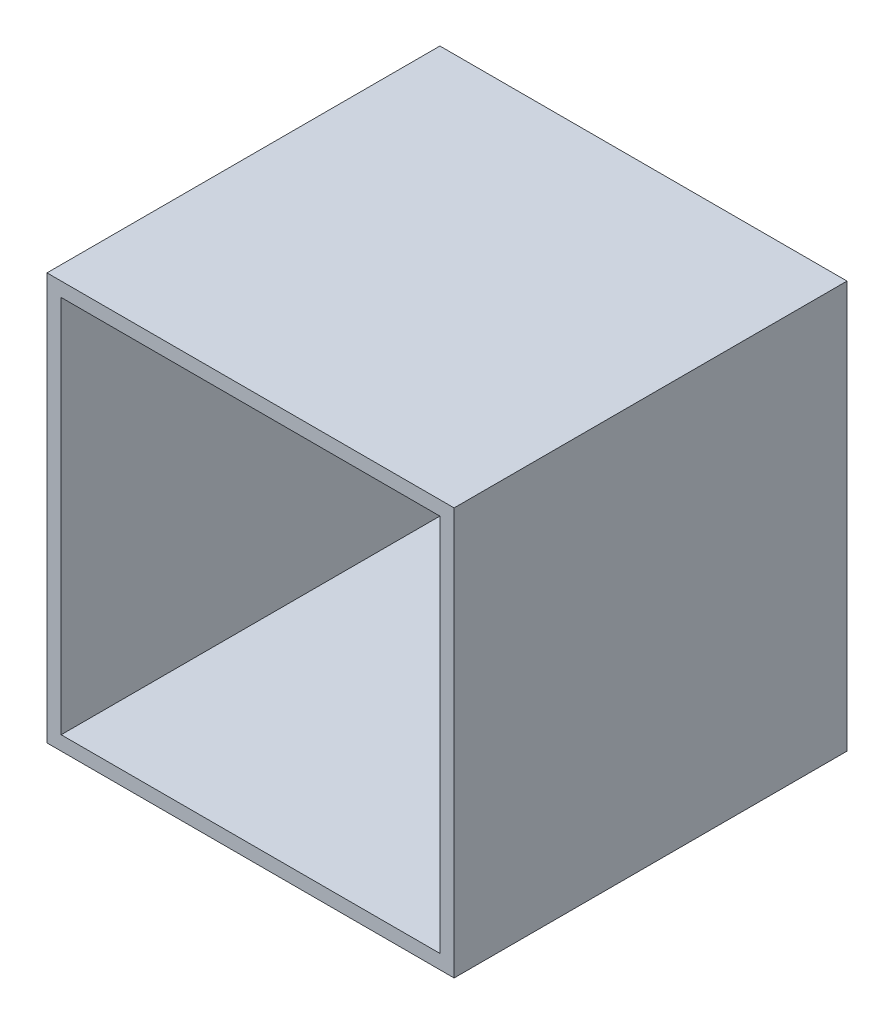
ISO-10303-21;
HEADER;
FILE_DESCRIPTION(('STEP AP214'),'2;1');
FILE_NAME('part.step','',(''),(''),'','','');
FILE_SCHEMA(('AUTOMOTIVE_DESIGN { 1 0 10303 214 1 1 1 1 }'));
ENDSEC;
DATA;
#1=APPLICATION_CONTEXT('core data for automotive mechanical design processes');
#2=APPLICATION_PROTOCOL_DEFINITION('international standard','automotive_design',2000,#1);
#3=PRODUCT_CONTEXT('',#1,'mechanical');
#4=PRODUCT('Part','Part','',(#3));
#5=PRODUCT_RELATED_PRODUCT_CATEGORY('part','',(#4));
#6=PRODUCT_DEFINITION_FORMATION('','',#4);
#7=PRODUCT_DEFINITION_CONTEXT('part definition',#1,'design');
#8=PRODUCT_DEFINITION('design','',#6,#7);
#9=PRODUCT_DEFINITION_SHAPE('','',#8);
#10=(LENGTH_UNIT() NAMED_UNIT(*) SI_UNIT(.MILLI.,.METRE.));
#11=(NAMED_UNIT(*) PLANE_ANGLE_UNIT() SI_UNIT($,.RADIAN.));
#12=(NAMED_UNIT(*) SI_UNIT($,.STERADIAN.) SOLID_ANGLE_UNIT());
#13=UNCERTAINTY_MEASURE_WITH_UNIT(LENGTH_MEASURE(1.E-05),#10,'distance_accuracy_value','');
#14=(GEOMETRIC_REPRESENTATION_CONTEXT(3) GLOBAL_UNCERTAINTY_ASSIGNED_CONTEXT((#13)) GLOBAL_UNIT_ASSIGNED_CONTEXT((#10,
#11,#12)) REPRESENTATION_CONTEXT('',''));
#15=CARTESIAN_POINT('',(0.,0.,0.));
#16=DIRECTION('',(0.,0.,1.));
#17=DIRECTION('',(1.,0.,0.));
#18=AXIS2_PLACEMENT_3D('',#15,#16,#17);
#19=CARTESIAN_POINT('',(0.,0.,80.));
#20=DIRECTION('',(0.,0.,-1.));
#21=DIRECTION('',(-1.,0.,0.));
#22=AXIS2_PLACEMENT_3D('',#19,#20,#21);
#23=PLANE('',#22);
#24=DIRECTION('',(0.,1.,0.));
#25=VECTOR('',#24,1.);
#26=CARTESIAN_POINT('',(43.,43.,80.));
#27=LINE('',#26,#25);
#28=CARTESIAN_POINT('',(43.,-43.,80.));
#29=VERTEX_POINT('',#28);
#30=CARTESIAN_POINT('',(43.,43.,80.));
#31=VERTEX_POINT('',#30);
#32=EDGE_CURVE('E108',#29,#31,#27,.T.);
#33=ORIENTED_EDGE('',*,*,#32,.T.);
#34=DIRECTION('',(-1.,0.,0.));
#35=VECTOR('',#34,1.);
#36=CARTESIAN_POINT('',(43.,43.,80.));
#37=LINE('',#36,#35);
#38=CARTESIAN_POINT('',(-43.,43.,80.));
#39=VERTEX_POINT('',#38);
#40=EDGE_CURVE('E157',#31,#39,#37,.T.);
#41=ORIENTED_EDGE('',*,*,#40,.T.);
#42=DIRECTION('',(0.,-1.,0.));
#43=VECTOR('',#42,1.);
#44=CARTESIAN_POINT('',(-43.,43.,80.));
#45=LINE('',#44,#43);
#46=CARTESIAN_POINT('',(-43.,-43.,80.));
#47=VERTEX_POINT('',#46);
#48=EDGE_CURVE('E159',#39,#47,#45,.T.);
#49=ORIENTED_EDGE('',*,*,#48,.T.);
#50=DIRECTION('',(1.,0.,0.));
#51=VECTOR('',#50,1.);
#52=CARTESIAN_POINT('',(43.,-43.,80.));
#53=LINE('',#52,#51);
#54=EDGE_CURVE('E112',#47,#29,#53,.T.);
#55=ORIENTED_EDGE('',*,*,#54,.T.);
#56=EDGE_LOOP('',(#33,#41,#49,#55));
#57=FACE_BOUND('',#56,.T.);
#58=DIRECTION('',(0.,-1.,0.));
#59=VECTOR('',#58,1.);
#60=CARTESIAN_POINT('',(-40.,40.,80.));
#61=LINE('',#60,#59);
#62=CARTESIAN_POINT('',(-40.,40.,80.));
#63=VERTEX_POINT('',#62);
#64=CARTESIAN_POINT('',(-40.,-40.,80.));
#65=VERTEX_POINT('',#64);
#66=EDGE_CURVE('E131',#63,#65,#61,.T.);
#67=ORIENTED_EDGE('',*,*,#66,.F.);
#68=DIRECTION('',(-1.,0.,0.));
#69=VECTOR('',#68,1.);
#70=CARTESIAN_POINT('',(40.,40.,80.));
#71=LINE('',#70,#69);
#72=CARTESIAN_POINT('',(40.,40.,80.));
#73=VERTEX_POINT('',#72);
#74=EDGE_CURVE('E138',#73,#63,#71,.T.);
#75=ORIENTED_EDGE('',*,*,#74,.F.);
#76=DIRECTION('',(0.,1.,0.));
#77=VECTOR('',#76,1.);
#78=CARTESIAN_POINT('',(40.,40.,80.));
#79=LINE('',#78,#77);
#80=CARTESIAN_POINT('',(40.,-40.,80.));
#81=VERTEX_POINT('',#80);
#82=EDGE_CURVE('E136',#81,#73,#79,.T.);
#83=ORIENTED_EDGE('',*,*,#82,.F.);
#84=DIRECTION('',(1.,0.,0.));
#85=VECTOR('',#84,1.);
#86=CARTESIAN_POINT('',(40.,-40.,80.));
#87=LINE('',#86,#85);
#88=EDGE_CURVE('E133',#65,#81,#87,.T.);
#89=ORIENTED_EDGE('',*,*,#88,.F.);
#90=EDGE_LOOP('',(#67,#75,#83,#89));
#91=FACE_BOUND('',#90,.T.);
#92=ADVANCED_FACE('F35',(#57,#91),#23,.F.);
#93=CARTESIAN_POINT('',(43.,43.,80.));
#94=DIRECTION('',(-1.,0.,0.));
#95=DIRECTION('',(0.,-1.,0.));
#96=AXIS2_PLACEMENT_3D('',#93,#94,#95);
#97=PLANE('',#96);
#98=DIRECTION('',(0.,0.,-1.));
#99=VECTOR('',#98,1.);
#100=CARTESIAN_POINT('',(43.,-43.,80.));
#101=LINE('',#100,#99);
#102=CARTESIAN_POINT('',(43.,-43.,-3.));
#103=VERTEX_POINT('',#102);
#104=EDGE_CURVE('E102',#29,#103,#101,.T.);
#105=ORIENTED_EDGE('',*,*,#104,.T.);
#106=DIRECTION('',(0.,-1.,0.));
#107=VECTOR('',#106,1.);
#108=CARTESIAN_POINT('',(43.,43.,-3.));
#109=LINE('',#108,#107);
#110=CARTESIAN_POINT('',(43.,43.,-3.));
#111=VERTEX_POINT('',#110);
#112=EDGE_CURVE('E106',#111,#103,#109,.T.);
#113=ORIENTED_EDGE('',*,*,#112,.F.);
#114=DIRECTION('',(0.,0.,-1.));
#115=VECTOR('',#114,1.);
#116=CARTESIAN_POINT('',(43.,43.,80.));
#117=LINE('',#116,#115);
#118=EDGE_CURVE('E11',#31,#111,#117,.T.);
#119=ORIENTED_EDGE('',*,*,#118,.F.);
#120=ORIENTED_EDGE('',*,*,#32,.F.);
#121=EDGE_LOOP('',(#105,#113,#119,#120));
#122=FACE_BOUND('',#121,.T.);
#123=ADVANCED_FACE('F37',(#122),#97,.F.);
#124=CARTESIAN_POINT('',(43.,43.,80.));
#125=DIRECTION('',(0.,-1.,0.));
#126=DIRECTION('',(1.,0.,0.));
#127=AXIS2_PLACEMENT_3D('',#124,#125,#126);
#128=PLANE('',#127);
#129=ORIENTED_EDGE('',*,*,#118,.T.);
#130=DIRECTION('',(1.,0.,0.));
#131=VECTOR('',#130,1.);
#132=CARTESIAN_POINT('',(43.,43.,-3.));
#133=LINE('',#132,#131);
#134=CARTESIAN_POINT('',(-43.,43.,-3.));
#135=VERTEX_POINT('',#134);
#136=EDGE_CURVE('E126',#135,#111,#133,.T.);
#137=ORIENTED_EDGE('',*,*,#136,.F.);
#138=DIRECTION('',(0.,0.,-1.));
#139=VECTOR('',#138,1.);
#140=CARTESIAN_POINT('',(-43.,43.,80.));
#141=LINE('',#140,#139);
#142=EDGE_CURVE('E43',#39,#135,#141,.T.);
#143=ORIENTED_EDGE('',*,*,#142,.F.);
#144=ORIENTED_EDGE('',*,*,#40,.F.);
#145=EDGE_LOOP('',(#129,#137,#143,#144));
#146=FACE_BOUND('',#145,.T.);
#147=ADVANCED_FACE('F167',(#146),#128,.F.);
#148=CARTESIAN_POINT('',(-43.,43.,80.));
#149=DIRECTION('',(1.,0.,0.));
#150=DIRECTION('',(0.,1.,0.));
#151=AXIS2_PLACEMENT_3D('',#148,#149,#150);
#152=PLANE('',#151);
#153=ORIENTED_EDGE('',*,*,#142,.T.);
#154=DIRECTION('',(0.,1.,0.));
#155=VECTOR('',#154,1.);
#156=CARTESIAN_POINT('',(-43.,43.,-3.));
#157=LINE('',#156,#155);
#158=CARTESIAN_POINT('',(-43.,-43.,-3.));
#159=VERTEX_POINT('',#158);
#160=EDGE_CURVE('E121',#159,#135,#157,.T.);
#161=ORIENTED_EDGE('',*,*,#160,.F.);
#162=DIRECTION('',(0.,0.,-1.));
#163=VECTOR('',#162,1.);
#164=CARTESIAN_POINT('',(-43.,-43.,80.));
#165=LINE('',#164,#163);
#166=EDGE_CURVE('E111',#47,#159,#165,.T.);
#167=ORIENTED_EDGE('',*,*,#166,.F.);
#168=ORIENTED_EDGE('',*,*,#48,.F.);
#169=EDGE_LOOP('',(#153,#161,#167,#168));
#170=FACE_BOUND('',#169,.T.);
#171=ADVANCED_FACE('F165',(#170),#152,.F.);
#172=CARTESIAN_POINT('',(43.,-43.,80.));
#173=DIRECTION('',(0.,1.,0.));
#174=DIRECTION('',(-1.,0.,0.));
#175=AXIS2_PLACEMENT_3D('',#172,#173,#174);
#176=PLANE('',#175);
#177=ORIENTED_EDGE('',*,*,#166,.T.);
#178=DIRECTION('',(-1.,0.,0.));
#179=VECTOR('',#178,1.);
#180=CARTESIAN_POINT('',(43.,-43.,-3.));
#181=LINE('',#180,#179);
#182=EDGE_CURVE('E115',#103,#159,#181,.T.);
#183=ORIENTED_EDGE('',*,*,#182,.F.);
#184=ORIENTED_EDGE('',*,*,#104,.F.);
#185=ORIENTED_EDGE('',*,*,#54,.F.);
#186=EDGE_LOOP('',(#177,#183,#184,#185));
#187=FACE_BOUND('',#186,.T.);
#188=ADVANCED_FACE('F116',(#187),#176,.F.);
#189=CARTESIAN_POINT('',(-40.,40.,80.));
#190=DIRECTION('',(1.,0.,0.));
#191=DIRECTION('',(0.,1.,0.));
#192=AXIS2_PLACEMENT_3D('',#189,#190,#191);
#193=PLANE('',#192);
#194=DIRECTION('',(0.,-1.,0.));
#195=VECTOR('',#194,1.);
#196=CARTESIAN_POINT('',(-40.,40.,0.));
#197=LINE('',#196,#195);
#198=CARTESIAN_POINT('',(-40.,40.,0.));
#199=VERTEX_POINT('',#198);
#200=CARTESIAN_POINT('',(-40.,-40.,0.));
#201=VERTEX_POINT('',#200);
#202=EDGE_CURVE('E58',#199,#201,#197,.T.);
#203=ORIENTED_EDGE('',*,*,#202,.F.);
#204=DIRECTION('',(0.,0.,-1.));
#205=VECTOR('',#204,1.);
#206=CARTESIAN_POINT('',(-40.,40.,80.));
#207=LINE('',#206,#205);
#208=EDGE_CURVE('E140',#63,#199,#207,.T.);
#209=ORIENTED_EDGE('',*,*,#208,.F.);
#210=ORIENTED_EDGE('',*,*,#66,.T.);
#211=DIRECTION('',(0.,0.,-1.));
#212=VECTOR('',#211,1.);
#213=CARTESIAN_POINT('',(-40.,-40.,80.));
#214=LINE('',#213,#212);
#215=EDGE_CURVE('E154',#65,#201,#214,.T.);
#216=ORIENTED_EDGE('',*,*,#215,.T.);
#217=EDGE_LOOP('',(#203,#209,#210,#216));
#218=FACE_BOUND('',#217,.T.);
#219=ADVANCED_FACE('F177',(#218),#193,.T.);
#220=CARTESIAN_POINT('',(40.,-40.,80.));
#221=DIRECTION('',(0.,1.,0.));
#222=DIRECTION('',(-1.,0.,0.));
#223=AXIS2_PLACEMENT_3D('',#220,#221,#222);
#224=PLANE('',#223);
#225=DIRECTION('',(1.,0.,0.));
#226=VECTOR('',#225,1.);
#227=CARTESIAN_POINT('',(40.,-40.,0.));
#228=LINE('',#227,#226);
#229=CARTESIAN_POINT('',(40.,-40.,0.));
#230=VERTEX_POINT('',#229);
#231=EDGE_CURVE('E142',#201,#230,#228,.T.);
#232=ORIENTED_EDGE('',*,*,#231,.F.);
#233=ORIENTED_EDGE('',*,*,#215,.F.);
#234=ORIENTED_EDGE('',*,*,#88,.T.);
#235=DIRECTION('',(0.,0.,-1.));
#236=VECTOR('',#235,1.);
#237=CARTESIAN_POINT('',(40.,-40.,80.));
#238=LINE('',#237,#236);
#239=EDGE_CURVE('E152',#81,#230,#238,.T.);
#240=ORIENTED_EDGE('',*,*,#239,.T.);
#241=EDGE_LOOP('',(#232,#233,#234,#240));
#242=FACE_BOUND('',#241,.T.);
#243=ADVANCED_FACE('F179',(#242),#224,.T.);
#244=CARTESIAN_POINT('',(40.,40.,80.));
#245=DIRECTION('',(-1.,0.,0.));
#246=DIRECTION('',(0.,-1.,0.));
#247=AXIS2_PLACEMENT_3D('',#244,#245,#246);
#248=PLANE('',#247);
#249=DIRECTION('',(0.,1.,0.));
#250=VECTOR('',#249,1.);
#251=CARTESIAN_POINT('',(40.,40.,0.));
#252=LINE('',#251,#250);
#253=CARTESIAN_POINT('',(40.,40.,0.));
#254=VERTEX_POINT('',#253);
#255=EDGE_CURVE('E145',#230,#254,#252,.T.);
#256=ORIENTED_EDGE('',*,*,#255,.F.);
#257=ORIENTED_EDGE('',*,*,#239,.F.);
#258=ORIENTED_EDGE('',*,*,#82,.T.);
#259=DIRECTION('',(0.,0.,-1.));
#260=VECTOR('',#259,1.);
#261=CARTESIAN_POINT('',(40.,40.,80.));
#262=LINE('',#261,#260);
#263=EDGE_CURVE('E50',#73,#254,#262,.T.);
#264=ORIENTED_EDGE('',*,*,#263,.T.);
#265=EDGE_LOOP('',(#256,#257,#258,#264));
#266=FACE_BOUND('',#265,.T.);
#267=ADVANCED_FACE('F186',(#266),#248,.T.);
#268=CARTESIAN_POINT('',(40.,40.,80.));
#269=DIRECTION('',(0.,-1.,0.));
#270=DIRECTION('',(0.,0.,-1.));
#271=AXIS2_PLACEMENT_3D('',#268,#269,#270);
#272=PLANE('',#271);
#273=DIRECTION('',(-1.,0.,0.));
#274=VECTOR('',#273,1.);
#275=CARTESIAN_POINT('',(40.,40.,0.));
#276=LINE('',#275,#274);
#277=EDGE_CURVE('E134',#254,#199,#276,.T.);
#278=ORIENTED_EDGE('',*,*,#277,.F.);
#279=ORIENTED_EDGE('',*,*,#263,.F.);
#280=ORIENTED_EDGE('',*,*,#74,.T.);
#281=ORIENTED_EDGE('',*,*,#208,.T.);
#282=EDGE_LOOP('',(#278,#279,#280,#281));
#283=FACE_BOUND('',#282,.T.);
#284=ADVANCED_FACE('F184',(#283),#272,.T.);
#285=CARTESIAN_POINT('',(0.,0.,0.));
#286=DIRECTION('',(0.,0.,-1.));
#287=DIRECTION('',(-1.,0.,0.));
#288=AXIS2_PLACEMENT_3D('',#285,#286,#287);
#289=PLANE('',#288);
#290=ORIENTED_EDGE('',*,*,#255,.T.);
#291=ORIENTED_EDGE('',*,*,#277,.T.);
#292=ORIENTED_EDGE('',*,*,#202,.T.);
#293=ORIENTED_EDGE('',*,*,#231,.T.);
#294=EDGE_LOOP('',(#290,#291,#292,#293));
#295=FACE_BOUND('',#294,.T.);
#296=ADVANCED_FACE('F183',(#295),#289,.F.);
#297=CARTESIAN_POINT('',(0.,0.,-3.));
#298=DIRECTION('',(0.,0.,-1.));
#299=DIRECTION('',(-1.,0.,0.));
#300=AXIS2_PLACEMENT_3D('',#297,#298,#299);
#301=PLANE('',#300);
#302=ORIENTED_EDGE('',*,*,#112,.T.);
#303=ORIENTED_EDGE('',*,*,#182,.T.);
#304=ORIENTED_EDGE('',*,*,#160,.T.);
#305=ORIENTED_EDGE('',*,*,#136,.T.);
#306=EDGE_LOOP('',(#302,#303,#304,#305));
#307=FACE_BOUND('',#306,.T.);
#308=ADVANCED_FACE('F124',(#307),#301,.T.);
#309=CLOSED_SHELL('',(#92,#123,#147,#171,#188,#219,#243,#267,#284,#296,#308));
#310=MANIFOLD_SOLID_BREP('B2',#309);
#311=ADVANCED_BREP_SHAPE_REPRESENTATION('',(#18,#310),#14);
#312=SHAPE_DEFINITION_REPRESENTATION(#9,#311);
ENDSEC;
END-ISO-10303-21;
